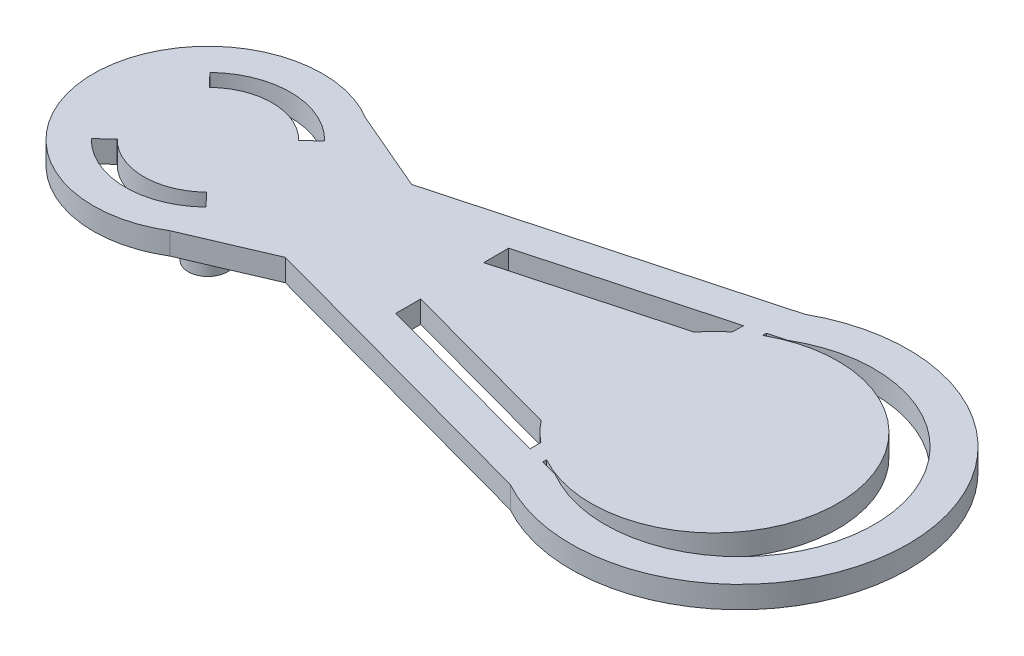
ISO-10303-21;
HEADER;
FILE_DESCRIPTION(('STEP AP214'),'2;1');
FILE_NAME('part.step','',(''),(''),'','','');
FILE_SCHEMA(('AUTOMOTIVE_DESIGN { 1 0 10303 214 1 1 1 1 }'));
ENDSEC;
DATA;
#1=APPLICATION_CONTEXT('core data for automotive mechanical design processes');
#2=APPLICATION_PROTOCOL_DEFINITION('international standard','automotive_design',2000,#1);
#3=PRODUCT_CONTEXT('',#1,'mechanical');
#4=PRODUCT('Part','Part','',(#3));
#5=PRODUCT_RELATED_PRODUCT_CATEGORY('part','',(#4));
#6=PRODUCT_DEFINITION_FORMATION('','',#4);
#7=PRODUCT_DEFINITION_CONTEXT('part definition',#1,'design');
#8=PRODUCT_DEFINITION('design','',#6,#7);
#9=PRODUCT_DEFINITION_SHAPE('','',#8);
#10=(LENGTH_UNIT() NAMED_UNIT(*) SI_UNIT(.MILLI.,.METRE.));
#11=(NAMED_UNIT(*) PLANE_ANGLE_UNIT() SI_UNIT($,.RADIAN.));
#12=(NAMED_UNIT(*) SI_UNIT($,.STERADIAN.) SOLID_ANGLE_UNIT());
#13=UNCERTAINTY_MEASURE_WITH_UNIT(LENGTH_MEASURE(1.E-05),#10,'distance_accuracy_value','');
#14=(GEOMETRIC_REPRESENTATION_CONTEXT(3) GLOBAL_UNCERTAINTY_ASSIGNED_CONTEXT((#13)) GLOBAL_UNIT_ASSIGNED_CONTEXT((#10,
#11,#12)) REPRESENTATION_CONTEXT('',''));
#15=CARTESIAN_POINT('',(0.,0.,0.));
#16=DIRECTION('',(0.,0.,1.));
#17=DIRECTION('',(1.,0.,0.));
#18=AXIS2_PLACEMENT_3D('',#15,#16,#17);
#19=CARTESIAN_POINT('',(0.,2.4,0.));
#20=DIRECTION('',(0.,1.,0.));
#21=DIRECTION('',(0.,0.,1.));
#22=AXIS2_PLACEMENT_3D('',#19,#20,#21);
#23=PLANE('',#22);
#24=DIRECTION('',(0.,0.,-1.));
#25=VECTOR('',#24,1.);
#26=CARTESIAN_POINT('',(-6.18025124375058,2.4,0.));
#27=LINE('',#26,#25);
#28=CARTESIAN_POINT('',(-6.18025124375058,2.4,12.1675980929111));
#29=VERTEX_POINT('',#28);
#30=CARTESIAN_POINT('',(-6.18025124375058,2.4,11.7587258032237));
#31=VERTEX_POINT('',#30);
#32=EDGE_CURVE('E319',#29,#31,#27,.T.);
#33=ORIENTED_EDGE('',*,*,#32,.T.);
#34=CARTESIAN_POINT('',(0.375497612093148,2.4,-9.56283843642691E-05));
#35=DIRECTION('',(0.,1.,0.));
#36=DIRECTION('',(0.,0.,1.));
#37=AXIS2_PLACEMENT_3D('',#34,#35,#36);
#38=CIRCLE('',#37,13.4628275084152);
#39=CARTESIAN_POINT('',(-6.14581100541854,2.4,-11.7780520910526));
#40=VERTEX_POINT('',#39);
#41=EDGE_CURVE('E1031',#31,#40,#38,.T.);
#42=ORIENTED_EDGE('',*,*,#41,.T.);
#43=DIRECTION('',(0.,0.,1.));
#44=VECTOR('',#43,1.);
#45=CARTESIAN_POINT('',(-6.14581100541854,2.4,0.));
#46=LINE('',#45,#44);
#47=CARTESIAN_POINT('',(-6.14581100541854,2.4,-12.1772605223885));
#48=VERTEX_POINT('',#47);
#49=EDGE_CURVE('E1034',#48,#40,#46,.T.);
#50=ORIENTED_EDGE('',*,*,#49,.F.);
#51=DIRECTION('',(-0.96486001562385,0.,0.262764438709547));
#52=VECTOR('',#51,1.);
#53=CARTESIAN_POINT('',(-3.51165026939695,2.4,-12.8946327381123));
#54=LINE('',#53,#52);
#55=CARTESIAN_POINT('',(-4.33622575678674,2.4,-12.6700725826399));
#56=VERTEX_POINT('',#55);
#57=EDGE_CURVE('E1040',#56,#48,#54,.T.);
#58=ORIENTED_EDGE('',*,*,#57,.F.);
#59=CARTESIAN_POINT('',(3.11758271611062,2.4,0.));
#60=DIRECTION('',(0.,1.,0.));
#61=DIRECTION('',(0.,0.,1.));
#62=AXIS2_PLACEMENT_3D('',#59,#60,#61);
#63=CIRCLE('',#62,14.7);
#64=CARTESIAN_POINT('',(-4.33694420692001,2.4,12.6696498907354));
#65=VERTEX_POINT('',#64);
#66=EDGE_CURVE('E1111',#65,#56,#63,.T.);
#67=ORIENTED_EDGE('',*,*,#66,.F.);
#68=DIRECTION('',(-0.964852565148683,0.,-0.262791795012719));
#69=VECTOR('',#68,1.);
#70=CARTESIAN_POINT('',(-3.51196467211747,2.4,12.8943452075438));
#71=LINE('',#70,#69);
#72=EDGE_CURVE('E1106',#65,#29,#71,.T.);
#73=ORIENTED_EDGE('',*,*,#72,.T.);
#74=EDGE_LOOP('',(#33,#42,#50,#58,#67,#73));
#75=FACE_BOUND('',#74,.T.);
#76=DIRECTION('',(0.9191008428755,0.,-0.39402238594469));
#77=VECTOR('',#76,1.);
#78=CARTESIAN_POINT('',(-3.64561910552785,2.4,-8.50381022047823));
#79=LINE('',#78,#77);
#80=CARTESIAN_POINT('',(-48.3711591182894,2.4,10.6702163567993));
#81=VERTEX_POINT('',#80);
#82=CARTESIAN_POINT('',(-39.556221528314,2.4,6.89121564313538));
#83=VERTEX_POINT('',#82);
#84=EDGE_CURVE('E408',#81,#83,#79,.T.);
#85=ORIENTED_EDGE('',*,*,#84,.T.);
#86=DIRECTION('',(0.964852565148683,0.,0.262791795012719));
#87=VECTOR('',#86,1.);
#88=CARTESIAN_POINT('',(-4.47903847776427,2.4,16.445002647291));
#89=LINE('',#88,#87);
#90=CARTESIAN_POINT('',(-5.82391822624473,2.4,16.0787048563689));
#91=VERTEX_POINT('',#90);
#92=EDGE_CURVE('E1099',#83,#91,#89,.T.);
#93=ORIENTED_EDGE('',*,*,#92,.T.);
#94=CARTESIAN_POINT('',(3.11758271611062,2.4,0.));
#95=DIRECTION('',(0.,1.,0.));
#96=DIRECTION('',(0.,0.,1.));
#97=AXIS2_PLACEMENT_3D('',#94,#95,#96);
#98=CIRCLE('',#97,18.3976952078342);
#99=CARTESIAN_POINT('',(-5.82753663345124,2.4,-16.0766920970222));
#100=VERTEX_POINT('',#99);
#101=EDGE_CURVE('E1096',#91,#100,#98,.T.);
#102=ORIENTED_EDGE('',*,*,#101,.T.);
#103=DIRECTION('',(0.96486001562385,0.,-0.262764438709547));
#104=VECTOR('',#103,1.);
#105=CARTESIAN_POINT('',(-4.47830136587958,2.4,-16.4441350856732));
#106=LINE('',#105,#104);
#107=CARTESIAN_POINT('',(-39.556221528314,2.4,-6.89121564313537));
#108=VERTEX_POINT('',#107);
#109=EDGE_CURVE('E1092',#108,#100,#106,.T.);
#110=ORIENTED_EDGE('',*,*,#109,.F.);
#111=DIRECTION('',(0.919100842875499,0.,0.394022385944691));
#112=VECTOR('',#111,1.);
#113=CARTESIAN_POINT('',(-3.64561910552788,2.4,8.50381022047827));
#114=LINE('',#113,#112);
#115=CARTESIAN_POINT('',(-48.3711591182894,2.4,-10.6702163567993));
#116=VERTEX_POINT('',#115);
#117=EDGE_CURVE('E1088',#116,#108,#114,.T.);
#118=ORIENTED_EDGE('',*,*,#117,.F.);
#119=CARTESIAN_POINT('',(-54.8824172838894,2.4,0.));
#120=DIRECTION('',(0.,1.,0.));
#121=DIRECTION('',(0.,0.,1.));
#122=AXIS2_PLACEMENT_3D('',#119,#120,#121);
#123=CIRCLE('',#122,12.5);
#124=EDGE_CURVE('E1085',#116,#81,#123,.T.);
#125=ORIENTED_EDGE('',*,*,#124,.T.);
#126=EDGE_LOOP('',(#85,#93,#102,#110,#118,#125));
#127=FACE_BOUND('',#126,.T.);
#128=DIRECTION('',(0.964852565148683,0.,0.262791795012719));
#129=VECTOR('',#128,1.);
#130=CARTESIAN_POINT('',(-2.82082225123402,2.4,10.3567829612028));
#131=LINE('',#130,#129);
#132=CARTESIAN_POINT('',(-28.2349134176837,2.4,3.43488123498516));
#133=VERTEX_POINT('',#132);
#134=CARTESIAN_POINT('',(-10.1839219187337,2.4,8.35133441043729));
#135=VERTEX_POINT('',#134);
#136=EDGE_CURVE('E414',#133,#135,#131,.T.);
#137=ORIENTED_EDGE('',*,*,#136,.T.);
#138=CARTESIAN_POINT('',(0.375497612093148,2.4,-9.56283843642691E-05));
#139=DIRECTION('',(0.,1.,0.));
#140=DIRECTION('',(0.,0.,1.));
#141=AXIS2_PLACEMENT_3D('',#138,#139,#140);
#142=CIRCLE('',#141,13.4628275084152);
#143=CARTESIAN_POINT('',(-8.1227588783313,2.4,10.4415211594651));
#144=VERTEX_POINT('',#143);
#145=EDGE_CURVE('E1080',#135,#144,#142,.T.);
#146=ORIENTED_EDGE('',*,*,#145,.T.);
#147=DIRECTION('',(-0.0145847739263874,0.,-0.999893636528164));
#148=VECTOR('',#147,1.);
#149=CARTESIAN_POINT('',(-8.27330206831559,2.4,0.120677075923863));
#150=LINE('',#149,#148);
#151=CARTESIAN_POINT('',(-8.10492728150916,2.4,11.6433842502474));
#152=VERTEX_POINT('',#151);
#153=EDGE_CURVE('E1075',#152,#144,#150,.T.);
#154=ORIENTED_EDGE('',*,*,#153,.F.);
#155=DIRECTION('',(-0.964852565148683,0.,-0.262791795012719));
#156=VECTOR('',#155,1.);
#157=CARTESIAN_POINT('',(-3.51196467211747,2.4,12.8943452075438));
#158=LINE('',#157,#156);
#159=CARTESIAN_POINT('',(-28.2349134176837,2.4,6.16068629059458));
#160=VERTEX_POINT('',#159);
#161=EDGE_CURVE('E1055',#152,#160,#158,.T.);
#162=ORIENTED_EDGE('',*,*,#161,.T.);
#163=DIRECTION('',(0.,0.,1.));
#164=VECTOR('',#163,1.);
#165=CARTESIAN_POINT('',(-28.2349134176837,2.4,0.));
#166=LINE('',#165,#164);
#167=EDGE_CURVE('E1051',#133,#160,#166,.T.);
#168=ORIENTED_EDGE('',*,*,#167,.F.);
#169=EDGE_LOOP('',(#137,#146,#154,#162,#168));
#170=FACE_BOUND('',#169,.T.);
#171=DIRECTION('',(-0.0123782056735885,0.,0.999923387077381));
#172=VECTOR('',#171,1.);
#173=CARTESIAN_POINT('',(-8.2475018721024,2.4,-0.102097096423137));
#174=LINE('',#173,#172);
#175=CARTESIAN_POINT('',(-8.10462525088231,2.4,-11.64380829366));
#176=VERTEX_POINT('',#175);
#177=CARTESIAN_POINT('',(-8.11947308663958,2.4,-10.4443858076648));
#178=VERTEX_POINT('',#177);
#179=EDGE_CURVE('E420',#176,#178,#174,.T.);
#180=ORIENTED_EDGE('',*,*,#179,.T.);
#181=CARTESIAN_POINT('',(-10.1847982189933,2.4,-8.3504175671649));
#182=VERTEX_POINT('',#181);
#183=EDGE_CURVE('E1036',#178,#182,#38,.T.);
#184=ORIENTED_EDGE('',*,*,#183,.T.);
#185=DIRECTION('',(0.96486001562385,0.,-0.262764438709547));
#186=VECTOR('',#185,1.);
#187=CARTESIAN_POINT('',(-2.82029980814216,2.4,-10.3560227948346));
#188=LINE('',#187,#186);
#189=CARTESIAN_POINT('',(-28.2349134176837,2.4,-3.43475279504777));
#190=VERTEX_POINT('',#189);
#191=EDGE_CURVE('E1043',#190,#182,#188,.T.);
#192=ORIENTED_EDGE('',*,*,#191,.F.);
#193=DIRECTION('',(0.,0.,1.));
#194=VECTOR('',#193,1.);
#195=CARTESIAN_POINT('',(-28.2349134176837,2.4,0.));
#196=LINE('',#195,#194);
#197=CARTESIAN_POINT('',(-28.2349134176837,2.4,-6.16164115484354));
#198=VERTEX_POINT('',#197);
#199=EDGE_CURVE('E1049',#198,#190,#196,.T.);
#200=ORIENTED_EDGE('',*,*,#199,.F.);
#201=DIRECTION('',(-0.96486001562385,0.,0.262764438709547));
#202=VECTOR('',#201,1.);
#203=CARTESIAN_POINT('',(-3.51165026939695,2.4,-12.8946327381123));
#204=LINE('',#203,#202);
#205=EDGE_CURVE('E884',#176,#198,#204,.T.);
#206=ORIENTED_EDGE('',*,*,#205,.F.);
#207=EDGE_LOOP('',(#180,#184,#192,#200,#206));
#208=FACE_BOUND('',#207,.T.);
#209=DIRECTION('',(-0.718496865807688,0.,0.695530196198935));
#210=VECTOR('',#209,1.);
#211=CARTESIAN_POINT('',(-26.5500418805926,2.4,-27.4267342848944));
#212=LINE('',#211,#210);
#213=CARTESIAN_POINT('',(-59.9118953413841,2.4,4.86871137033442));
#214=VERTEX_POINT('',#213);
#215=CARTESIAN_POINT('',(-61.3488890729995,2.4,6.25977176273229));
#216=VERTEX_POINT('',#215);
#217=EDGE_CURVE('E283',#214,#216,#212,.T.);
#218=ORIENTED_EDGE('',*,*,#217,.F.);
#219=CARTESIAN_POINT('',(-54.8824172838894,2.4,0.));
#220=DIRECTION('',(0.,1.,0.));
#221=DIRECTION('',(0.,0.,1.));
#222=AXIS2_PLACEMENT_3D('',#219,#220,#221);
#223=CIRCLE('',#222,6.99999999560317);
#224=CARTESIAN_POINT('',(-50.013705913555,2.4,5.02947805749471));
#225=VERTEX_POINT('',#224);
#226=EDGE_CURVE('E69',#214,#225,#223,.T.);
#227=ORIENTED_EDGE('',*,*,#226,.T.);
#228=DIRECTION('',(0.695530196198935,0.,0.718496865807688));
#229=VECTOR('',#228,1.);
#230=CARTESIAN_POINT('',(-28.3323754032968,2.4,27.4267342848944));
#231=LINE('',#230,#229);
#232=CARTESIAN_POINT('',(-48.6226455211571,2.4,6.46647178911009));
#233=VERTEX_POINT('',#232);
#234=EDGE_CURVE('E291',#225,#233,#231,.T.);
#235=ORIENTED_EDGE('',*,*,#234,.T.);
#236=CARTESIAN_POINT('',(-54.8824172838894,2.4,0.));
#237=DIRECTION('',(0.,1.,0.));
#238=DIRECTION('',(0.,0.,1.));
#239=AXIS2_PLACEMENT_3D('',#236,#237,#238);
#240=CIRCLE('',#239,8.99999999560318);
#241=EDGE_CURVE('E287',#216,#233,#240,.T.);
#242=ORIENTED_EDGE('',*,*,#241,.F.);
#243=EDGE_LOOP('',(#218,#227,#235,#242));
#244=FACE_BOUND('',#243,.T.);
#245=DIRECTION('',(-0.718496865807688,0.,0.695530196198935));
#246=VECTOR('',#245,1.);
#247=CARTESIAN_POINT('',(-26.5500418805926,2.4,-27.4267342848944));
#248=LINE('',#247,#246);
#249=CARTESIAN_POINT('',(-48.4159454947793,2.4,-6.2597717627323));
#250=VERTEX_POINT('',#249);
#251=CARTESIAN_POINT('',(-49.8529392263947,2.4,-4.86871137033442));
#252=VERTEX_POINT('',#251);
#253=EDGE_CURVE('E260',#250,#252,#248,.T.);
#254=ORIENTED_EDGE('',*,*,#253,.T.);
#255=CARTESIAN_POINT('',(-54.8824172838894,2.4,0.));
#256=DIRECTION('',(0.,1.,0.));
#257=DIRECTION('',(0.,0.,1.));
#258=AXIS2_PLACEMENT_3D('',#255,#256,#257);
#259=CIRCLE('',#258,6.99999999560317);
#260=CARTESIAN_POINT('',(-59.7511286542238,2.4,-5.02947805749471));
#261=VERTEX_POINT('',#260);
#262=EDGE_CURVE('E61',#252,#261,#259,.T.);
#263=ORIENTED_EDGE('',*,*,#262,.T.);
#264=DIRECTION('',(0.695530196198935,0.,0.718496865807688));
#265=VECTOR('',#264,1.);
#266=CARTESIAN_POINT('',(-28.3323754032968,2.4,27.4267342848944));
#267=LINE('',#266,#265);
#268=CARTESIAN_POINT('',(-61.1421890466217,2.4,-6.46647178911008));
#269=VERTEX_POINT('',#268);
#270=EDGE_CURVE('E266',#269,#261,#267,.T.);
#271=ORIENTED_EDGE('',*,*,#270,.F.);
#272=CARTESIAN_POINT('',(-54.8824172838894,2.4,0.));
#273=DIRECTION('',(0.,1.,0.));
#274=DIRECTION('',(0.,0.,1.));
#275=AXIS2_PLACEMENT_3D('',#272,#273,#274);
#276=CIRCLE('',#275,8.99999999560318);
#277=EDGE_CURVE('E249',#250,#269,#276,.T.);
#278=ORIENTED_EDGE('',*,*,#277,.F.);
#279=EDGE_LOOP('',(#254,#263,#271,#278));
#280=FACE_BOUND('',#279,.T.);
#281=ADVANCED_FACE('F44',(#75,#127,#170,#208,#244,#280),#23,.T.);
#282=CARTESIAN_POINT('',(0.,0.,0.));
#283=DIRECTION('',(0.,1.,0.));
#284=DIRECTION('',(0.,0.,1.));
#285=AXIS2_PLACEMENT_3D('',#282,#283,#284);
#286=PLANE('',#285);
#287=CARTESIAN_POINT('',(-54.8824172838894,0.,0.));
#288=DIRECTION('',(0.,1.,0.));
#289=DIRECTION('',(0.,0.,1.));
#290=AXIS2_PLACEMENT_3D('',#287,#288,#289);
#291=CIRCLE('',#290,6.99999999560317);
#292=CARTESIAN_POINT('',(-59.9118953413841,0.,4.86871137033442));
#293=VERTEX_POINT('',#292);
#294=CARTESIAN_POINT('',(-50.013705913555,0.,5.02947805749471));
#295=VERTEX_POINT('',#294);
#296=EDGE_CURVE('E364',#293,#295,#291,.T.);
#297=ORIENTED_EDGE('',*,*,#296,.F.);
#298=DIRECTION('',(-0.718496865807688,0.,0.695530196198935));
#299=VECTOR('',#298,1.);
#300=CARTESIAN_POINT('',(-26.5500418805926,0.,-27.4267342848944));
#301=LINE('',#300,#299);
#302=CARTESIAN_POINT('',(-61.3488890729995,0.,6.25977176273229));
#303=VERTEX_POINT('',#302);
#304=EDGE_CURVE('E347',#293,#303,#301,.T.);
#305=ORIENTED_EDGE('',*,*,#304,.T.);
#306=CARTESIAN_POINT('',(-54.8824172838894,0.,0.));
#307=DIRECTION('',(0.,1.,0.));
#308=DIRECTION('',(0.,0.,1.));
#309=AXIS2_PLACEMENT_3D('',#306,#307,#308);
#310=CIRCLE('',#309,8.99999999560318);
#311=CARTESIAN_POINT('',(-48.6226455211571,0.,6.46647178911009));
#312=VERTEX_POINT('',#311);
#313=EDGE_CURVE('E356',#303,#312,#310,.T.);
#314=ORIENTED_EDGE('',*,*,#313,.T.);
#315=DIRECTION('',(0.695530196198935,0.,0.718496865807688));
#316=VECTOR('',#315,1.);
#317=CARTESIAN_POINT('',(-28.3323754032968,0.,27.4267342848944));
#318=LINE('',#317,#316);
#319=EDGE_CURVE('E361',#295,#312,#318,.T.);
#320=ORIENTED_EDGE('',*,*,#319,.F.);
#321=EDGE_LOOP('',(#297,#305,#314,#320));
#322=FACE_BOUND('',#321,.T.);
#323=CARTESIAN_POINT('',(-54.8824198469725,0.,-1.14636437971353E-05));
#324=DIRECTION('',(0.,1.,0.));
#325=DIRECTION('',(0.,0.,1.));
#326=AXIS2_PLACEMENT_3D('',#323,#324,#325);
#327=CIRCLE('',#326,2.15001174668141);
#328=CARTESIAN_POINT('',(-54.8824198469725,0.,2.15000028303762));
#329=VERTEX_POINT('',#328);
#330=EDGE_CURVE('E861',#329,#329,#327,.T.);
#331=ORIENTED_EDGE('',*,*,#330,.T.);
#332=EDGE_LOOP('',(#331));
#333=FACE_BOUND('',#332,.T.);
#334=DIRECTION('',(0.,0.,-1.));
#335=VECTOR('',#334,1.);
#336=CARTESIAN_POINT('',(-6.18025124375058,0.,0.));
#337=LINE('',#336,#335);
#338=CARTESIAN_POINT('',(-6.18025124375058,0.,12.1675980929111));
#339=VERTEX_POINT('',#338);
#340=CARTESIAN_POINT('',(-6.18025124375058,0.,11.7587258032237));
#341=VERTEX_POINT('',#340);
#342=EDGE_CURVE('E870',#339,#341,#337,.T.);
#343=ORIENTED_EDGE('',*,*,#342,.F.);
#344=DIRECTION('',(-0.964852565148683,0.,-0.262791795012719));
#345=VECTOR('',#344,1.);
#346=CARTESIAN_POINT('',(-3.51196467211747,0.,12.8943452075438));
#347=LINE('',#346,#345);
#348=CARTESIAN_POINT('',(-4.33694420692001,0.,12.6696498907354));
#349=VERTEX_POINT('',#348);
#350=EDGE_CURVE('E899',#349,#339,#347,.T.);
#351=ORIENTED_EDGE('',*,*,#350,.F.);
#352=CARTESIAN_POINT('',(3.11758271611062,0.,0.));
#353=DIRECTION('',(0.,1.,0.));
#354=DIRECTION('',(0.,0.,1.));
#355=AXIS2_PLACEMENT_3D('',#352,#353,#354);
#356=CIRCLE('',#355,14.7);
#357=CARTESIAN_POINT('',(-4.33622575678674,0.,-12.6700725826399));
#358=VERTEX_POINT('',#357);
#359=EDGE_CURVE('E895',#349,#358,#356,.T.);
#360=ORIENTED_EDGE('',*,*,#359,.T.);
#361=DIRECTION('',(-0.96486001562385,0.,0.262764438709547));
#362=VECTOR('',#361,1.);
#363=CARTESIAN_POINT('',(-3.51165026939695,0.,-12.8946327381123));
#364=LINE('',#363,#362);
#365=CARTESIAN_POINT('',(-6.14581100541854,0.,-12.1772605223885));
#366=VERTEX_POINT('',#365);
#367=EDGE_CURVE('E891',#358,#366,#364,.T.);
#368=ORIENTED_EDGE('',*,*,#367,.T.);
#369=DIRECTION('',(0.,0.,1.));
#370=VECTOR('',#369,1.);
#371=CARTESIAN_POINT('',(-6.14581100541854,0.,0.));
#372=LINE('',#371,#370);
#373=CARTESIAN_POINT('',(-6.14581100541854,0.,-11.7780520910526));
#374=VERTEX_POINT('',#373);
#375=EDGE_CURVE('E879',#366,#374,#372,.T.);
#376=ORIENTED_EDGE('',*,*,#375,.T.);
#377=CARTESIAN_POINT('',(0.375497612093148,0.,-9.56283843642691E-05));
#378=DIRECTION('',(0.,1.,0.));
#379=DIRECTION('',(0.,0.,1.));
#380=AXIS2_PLACEMENT_3D('',#377,#378,#379);
#381=CIRCLE('',#380,13.4628275084152);
#382=EDGE_CURVE('E874',#341,#374,#381,.T.);
#383=ORIENTED_EDGE('',*,*,#382,.F.);
#384=EDGE_LOOP('',(#343,#351,#360,#368,#376,#383));
#385=FACE_BOUND('',#384,.T.);
#386=DIRECTION('',(0.9191008428755,0.,-0.39402238594469));
#387=VECTOR('',#386,1.);
#388=CARTESIAN_POINT('',(-3.64561910552785,0.,-8.50381022047823));
#389=LINE('',#388,#387);
#390=CARTESIAN_POINT('',(-48.3711591182894,0.,10.6702163567993));
#391=VERTEX_POINT('',#390);
#392=CARTESIAN_POINT('',(-39.556221528314,0.,6.89121564313538));
#393=VERTEX_POINT('',#392);
#394=EDGE_CURVE('E902',#391,#393,#389,.T.);
#395=ORIENTED_EDGE('',*,*,#394,.F.);
#396=CARTESIAN_POINT('',(-54.8824172838894,0.,0.));
#397=DIRECTION('',(0.,1.,0.));
#398=DIRECTION('',(0.,0.,1.));
#399=AXIS2_PLACEMENT_3D('',#396,#397,#398);
#400=CIRCLE('',#399,12.5);
#401=CARTESIAN_POINT('',(-48.3711591182894,0.,-10.6702163567993));
#402=VERTEX_POINT('',#401);
#403=EDGE_CURVE('E925',#402,#391,#400,.T.);
#404=ORIENTED_EDGE('',*,*,#403,.F.);
#405=DIRECTION('',(0.919100842875499,0.,0.394022385944691));
#406=VECTOR('',#405,1.);
#407=CARTESIAN_POINT('',(-3.64561910552788,0.,8.50381022047827));
#408=LINE('',#407,#406);
#409=CARTESIAN_POINT('',(-39.556221528314,0.,-6.89121564313537));
#410=VERTEX_POINT('',#409);
#411=EDGE_CURVE('E921',#402,#410,#408,.T.);
#412=ORIENTED_EDGE('',*,*,#411,.T.);
#413=DIRECTION('',(0.96486001562385,0.,-0.262764438709547));
#414=VECTOR('',#413,1.);
#415=CARTESIAN_POINT('',(-4.47830136587958,0.,-16.4441350856732));
#416=LINE('',#415,#414);
#417=CARTESIAN_POINT('',(-5.82753663345124,0.,-16.0766920970222));
#418=VERTEX_POINT('',#417);
#419=EDGE_CURVE('E917',#410,#418,#416,.T.);
#420=ORIENTED_EDGE('',*,*,#419,.T.);
#421=CARTESIAN_POINT('',(3.11758271611062,0.,0.));
#422=DIRECTION('',(0.,1.,0.));
#423=DIRECTION('',(0.,0.,1.));
#424=AXIS2_PLACEMENT_3D('',#421,#422,#423);
#425=CIRCLE('',#424,18.3976952078342);
#426=CARTESIAN_POINT('',(-5.82391822624473,0.,16.0787048563689));
#427=VERTEX_POINT('',#426);
#428=EDGE_CURVE('E911',#427,#418,#425,.T.);
#429=ORIENTED_EDGE('',*,*,#428,.F.);
#430=DIRECTION('',(0.964852565148683,0.,0.262791795012719));
#431=VECTOR('',#430,1.);
#432=CARTESIAN_POINT('',(-4.47903847776427,0.,16.445002647291));
#433=LINE('',#432,#431);
#434=EDGE_CURVE('E908',#393,#427,#433,.T.);
#435=ORIENTED_EDGE('',*,*,#434,.F.);
#436=EDGE_LOOP('',(#395,#404,#412,#420,#429,#435));
#437=FACE_BOUND('',#436,.T.);
#438=DIRECTION('',(0.964852565148683,0.,0.262791795012719));
#439=VECTOR('',#438,1.);
#440=CARTESIAN_POINT('',(-2.82082225123402,0.,10.3567829612028));
#441=LINE('',#440,#439);
#442=CARTESIAN_POINT('',(-28.2349134176837,0.,3.43488123498516));
#443=VERTEX_POINT('',#442);
#444=CARTESIAN_POINT('',(-10.1839219187337,0.,8.35133441043729));
#445=VERTEX_POINT('',#444);
#446=EDGE_CURVE('E928',#443,#445,#441,.T.);
#447=ORIENTED_EDGE('',*,*,#446,.F.);
#448=DIRECTION('',(0.,0.,1.));
#449=VECTOR('',#448,1.);
#450=CARTESIAN_POINT('',(-28.2349134176837,0.,0.));
#451=LINE('',#450,#449);
#452=CARTESIAN_POINT('',(-28.2349134176837,0.,6.16068629059458));
#453=VERTEX_POINT('',#452);
#454=EDGE_CURVE('E946',#443,#453,#451,.T.);
#455=ORIENTED_EDGE('',*,*,#454,.T.);
#456=DIRECTION('',(-0.964852565148683,0.,-0.262791795012719));
#457=VECTOR('',#456,1.);
#458=CARTESIAN_POINT('',(-3.51196467211747,0.,12.8943452075438));
#459=LINE('',#458,#457);
#460=CARTESIAN_POINT('',(-8.10492728150916,0.,11.6433842502474));
#461=VERTEX_POINT('',#460);
#462=EDGE_CURVE('E940',#461,#453,#459,.T.);
#463=ORIENTED_EDGE('',*,*,#462,.F.);
#464=DIRECTION('',(-0.0145847739263874,0.,-0.999893636528164));
#465=VECTOR('',#464,1.);
#466=CARTESIAN_POINT('',(-8.27330206831559,0.,0.120677075923863));
#467=LINE('',#466,#465);
#468=CARTESIAN_POINT('',(-8.1227588783313,0.,10.4415211594651));
#469=VERTEX_POINT('',#468);
#470=EDGE_CURVE('E936',#461,#469,#467,.T.);
#471=ORIENTED_EDGE('',*,*,#470,.T.);
#472=CARTESIAN_POINT('',(0.375497612093148,0.,-9.56283843642691E-05));
#473=DIRECTION('',(0.,1.,0.));
#474=DIRECTION('',(0.,0.,1.));
#475=AXIS2_PLACEMENT_3D('',#472,#473,#474);
#476=CIRCLE('',#475,13.4628275084152);
#477=EDGE_CURVE('E932',#445,#469,#476,.T.);
#478=ORIENTED_EDGE('',*,*,#477,.F.);
#479=EDGE_LOOP('',(#447,#455,#463,#471,#478));
#480=FACE_BOUND('',#479,.T.);
#481=DIRECTION('',(-0.0123782056735885,0.,0.999923387077381));
#482=VECTOR('',#481,1.);
#483=CARTESIAN_POINT('',(-8.2475018721024,0.,-0.102097096423137));
#484=LINE('',#483,#482);
#485=CARTESIAN_POINT('',(-8.10462525088231,0.,-11.64380829366));
#486=VERTEX_POINT('',#485);
#487=CARTESIAN_POINT('',(-8.11947308663958,0.,-10.4443858076648));
#488=VERTEX_POINT('',#487);
#489=EDGE_CURVE('E952',#486,#488,#484,.T.);
#490=ORIENTED_EDGE('',*,*,#489,.F.);
#491=DIRECTION('',(-0.96486001562385,0.,0.262764438709547));
#492=VECTOR('',#491,1.);
#493=CARTESIAN_POINT('',(-3.51165026939695,0.,-12.8946327381123));
#494=LINE('',#493,#492);
#495=CARTESIAN_POINT('',(-28.2349134176837,0.,-6.16164115484354));
#496=VERTEX_POINT('',#495);
#497=EDGE_CURVE('E963',#486,#496,#494,.T.);
#498=ORIENTED_EDGE('',*,*,#497,.T.);
#499=DIRECTION('',(0.,0.,1.));
#500=VECTOR('',#499,1.);
#501=CARTESIAN_POINT('',(-28.2349134176837,0.,0.));
#502=LINE('',#501,#500);
#503=CARTESIAN_POINT('',(-28.2349134176837,0.,-3.43475279504777));
#504=VERTEX_POINT('',#503);
#505=EDGE_CURVE('E959',#496,#504,#502,.T.);
#506=ORIENTED_EDGE('',*,*,#505,.T.);
#507=DIRECTION('',(0.96486001562385,0.,-0.262764438709547));
#508=VECTOR('',#507,1.);
#509=CARTESIAN_POINT('',(-2.82029980814216,0.,-10.3560227948346));
#510=LINE('',#509,#508);
#511=CARTESIAN_POINT('',(-10.1847982189933,0.,-8.3504175671649));
#512=VERTEX_POINT('',#511);
#513=EDGE_CURVE('E955',#504,#512,#510,.T.);
#514=ORIENTED_EDGE('',*,*,#513,.T.);
#515=EDGE_CURVE('E881',#488,#512,#381,.T.);
#516=ORIENTED_EDGE('',*,*,#515,.F.);
#517=EDGE_LOOP('',(#490,#498,#506,#514,#516));
#518=FACE_BOUND('',#517,.T.);
#519=CARTESIAN_POINT('',(-54.8824172838894,0.,0.));
#520=DIRECTION('',(0.,1.,0.));
#521=DIRECTION('',(0.,0.,1.));
#522=AXIS2_PLACEMENT_3D('',#519,#520,#521);
#523=CIRCLE('',#522,6.99999999560317);
#524=CARTESIAN_POINT('',(-49.8529392263947,0.,-4.86871137033442));
#525=VERTEX_POINT('',#524);
#526=CARTESIAN_POINT('',(-59.7511286542238,0.,-5.02947805749471));
#527=VERTEX_POINT('',#526);
#528=EDGE_CURVE('E11',#525,#527,#523,.T.);
#529=ORIENTED_EDGE('',*,*,#528,.F.);
#530=DIRECTION('',(-0.718496865807688,0.,0.695530196198935));
#531=VECTOR('',#530,1.);
#532=CARTESIAN_POINT('',(-26.5500418805926,0.,-27.4267342848944));
#533=LINE('',#532,#531);
#534=CARTESIAN_POINT('',(-48.4159454947793,0.,-6.2597717627323));
#535=VERTEX_POINT('',#534);
#536=EDGE_CURVE('E367',#535,#525,#533,.T.);
#537=ORIENTED_EDGE('',*,*,#536,.F.);
#538=CARTESIAN_POINT('',(-54.8824172838894,0.,0.));
#539=DIRECTION('',(0.,1.,0.));
#540=DIRECTION('',(0.,0.,1.));
#541=AXIS2_PLACEMENT_3D('',#538,#539,#540);
#542=CIRCLE('',#541,8.99999999560318);
#543=CARTESIAN_POINT('',(-61.1421890466217,0.,-6.46647178911008));
#544=VERTEX_POINT('',#543);
#545=EDGE_CURVE('E252',#535,#544,#542,.T.);
#546=ORIENTED_EDGE('',*,*,#545,.T.);
#547=DIRECTION('',(0.695530196198935,0.,0.718496865807688));
#548=VECTOR('',#547,1.);
#549=CARTESIAN_POINT('',(-28.3323754032968,0.,27.4267342848944));
#550=LINE('',#549,#548);
#551=EDGE_CURVE('E54',#544,#527,#550,.T.);
#552=ORIENTED_EDGE('',*,*,#551,.T.);
#553=EDGE_LOOP('',(#529,#537,#546,#552));
#554=FACE_BOUND('',#553,.T.);
#555=ADVANCED_FACE('F375',(#322,#333,#385,#437,#480,#518,#554),#286,.F.);
#556=CARTESIAN_POINT('',(-8.2475018721024,2.4,-0.102097096423137));
#557=DIRECTION('',(0.999923387077381,0.,0.0123782056735885));
#558=DIRECTION('',(0.0123782056735885,0.,-0.999923387077381));
#559=AXIS2_PLACEMENT_3D('',#556,#557,#558);
#560=PLANE('',#559);
#561=ORIENTED_EDGE('',*,*,#489,.T.);
#562=DIRECTION('',(0.,-1.,0.));
#563=VECTOR('',#562,1.);
#564=CARTESIAN_POINT('',(-8.11947308663958,2.4,-10.4443858076648));
#565=LINE('',#564,#563);
#566=EDGE_CURVE('E357',#178,#488,#565,.T.);
#567=ORIENTED_EDGE('',*,*,#566,.F.);
#568=ORIENTED_EDGE('',*,*,#179,.F.);
#569=DIRECTION('',(0.,-1.,0.));
#570=VECTOR('',#569,1.);
#571=CARTESIAN_POINT('',(-8.10462525088231,2.4,-11.64380829366));
#572=LINE('',#571,#570);
#573=EDGE_CURVE('E967',#176,#486,#572,.T.);
#574=ORIENTED_EDGE('',*,*,#573,.T.);
#575=EDGE_LOOP('',(#561,#567,#568,#574));
#576=FACE_BOUND('',#575,.T.);
#577=ADVANCED_FACE('F399',(#576),#560,.F.);
#578=CARTESIAN_POINT('',(0.375497612093148,2.4,-9.56283843642691E-05));
#579=DIRECTION('',(0.,-1.,0.));
#580=DIRECTION('',(0.,0.,-1.));
#581=AXIS2_PLACEMENT_3D('',#578,#579,#580);
#582=CYLINDRICAL_SURFACE('',#581,13.4628275084152);
#583=ORIENTED_EDGE('',*,*,#515,.T.);
#584=DIRECTION('',(0.,-1.,0.));
#585=VECTOR('',#584,1.);
#586=CARTESIAN_POINT('',(-10.1847982189933,2.4,-8.3504175671649));
#587=LINE('',#586,#585);
#588=EDGE_CURVE('E977',#182,#512,#587,.T.);
#589=ORIENTED_EDGE('',*,*,#588,.F.);
#590=ORIENTED_EDGE('',*,*,#183,.F.);
#591=ORIENTED_EDGE('',*,*,#566,.T.);
#592=EDGE_LOOP('',(#583,#589,#590,#591));
#593=FACE_BOUND('',#592,.T.);
#594=ADVANCED_FACE('F631',(#593),#582,.T.);
#595=CARTESIAN_POINT('',(-2.82029980814216,2.4,-10.3560227948346));
#596=DIRECTION('',(-0.262764438709547,0.,-0.96486001562385));
#597=DIRECTION('',(-0.96486001562385,0.,0.262764438709547));
#598=AXIS2_PLACEMENT_3D('',#595,#596,#597);
#599=PLANE('',#598);
#600=ORIENTED_EDGE('',*,*,#513,.F.);
#601=DIRECTION('',(0.,-1.,0.));
#602=VECTOR('',#601,1.);
#603=CARTESIAN_POINT('',(-28.2349134176837,2.4,-3.43475279504777));
#604=LINE('',#603,#602);
#605=EDGE_CURVE('E974',#190,#504,#604,.T.);
#606=ORIENTED_EDGE('',*,*,#605,.F.);
#607=ORIENTED_EDGE('',*,*,#191,.T.);
#608=ORIENTED_EDGE('',*,*,#588,.T.);
#609=EDGE_LOOP('',(#600,#606,#607,#608));
#610=FACE_BOUND('',#609,.T.);
#611=ADVANCED_FACE('F738',(#610),#599,.T.);
#612=CARTESIAN_POINT('',(-28.2349134176837,2.4,0.));
#613=DIRECTION('',(1.,0.,0.));
#614=DIRECTION('',(0.,0.,-1.));
#615=AXIS2_PLACEMENT_3D('',#612,#613,#614);
#616=PLANE('',#615);
#617=ORIENTED_EDGE('',*,*,#505,.F.);
#618=DIRECTION('',(0.,-1.,0.));
#619=VECTOR('',#618,1.);
#620=CARTESIAN_POINT('',(-28.2349134176837,2.4,-6.16164115484354));
#621=LINE('',#620,#619);
#622=EDGE_CURVE('E970',#198,#496,#621,.T.);
#623=ORIENTED_EDGE('',*,*,#622,.F.);
#624=ORIENTED_EDGE('',*,*,#199,.T.);
#625=ORIENTED_EDGE('',*,*,#605,.T.);
#626=EDGE_LOOP('',(#617,#623,#624,#625));
#627=FACE_BOUND('',#626,.T.);
#628=ADVANCED_FACE('F728',(#627),#616,.T.);
#629=CARTESIAN_POINT('',(-2.82082225123402,2.4,10.3567829612028));
#630=DIRECTION('',(0.262791795012719,0.,-0.964852565148683));
#631=DIRECTION('',(-0.964852565148683,0.,-0.262791795012719));
#632=AXIS2_PLACEMENT_3D('',#629,#630,#631);
#633=PLANE('',#632);
#634=ORIENTED_EDGE('',*,*,#446,.T.);
#635=DIRECTION('',(0.,-1.,0.));
#636=VECTOR('',#635,1.);
#637=CARTESIAN_POINT('',(-10.1839219187337,2.4,8.35133441043729));
#638=LINE('',#637,#636);
#639=EDGE_CURVE('E971',#135,#445,#638,.T.);
#640=ORIENTED_EDGE('',*,*,#639,.F.);
#641=ORIENTED_EDGE('',*,*,#136,.F.);
#642=DIRECTION('',(0.,-1.,0.));
#643=VECTOR('',#642,1.);
#644=CARTESIAN_POINT('',(-28.2349134176837,2.4,3.43488123498516));
#645=LINE('',#644,#643);
#646=EDGE_CURVE('E983',#133,#443,#645,.T.);
#647=ORIENTED_EDGE('',*,*,#646,.T.);
#648=EDGE_LOOP('',(#634,#640,#641,#647));
#649=FACE_BOUND('',#648,.T.);
#650=ADVANCED_FACE('F718',(#649),#633,.F.);
#651=CARTESIAN_POINT('',(0.375497612093148,2.4,-9.56283843642691E-05));
#652=DIRECTION('',(0.,-1.,0.));
#653=DIRECTION('',(0.,0.,-1.));
#654=AXIS2_PLACEMENT_3D('',#651,#652,#653);
#655=CYLINDRICAL_SURFACE('',#654,13.4628275084152);
#656=ORIENTED_EDGE('',*,*,#477,.T.);
#657=DIRECTION('',(0.,-1.,0.));
#658=VECTOR('',#657,1.);
#659=CARTESIAN_POINT('',(-8.1227588783313,2.4,10.4415211594651));
#660=LINE('',#659,#658);
#661=EDGE_CURVE('E990',#144,#469,#660,.T.);
#662=ORIENTED_EDGE('',*,*,#661,.F.);
#663=ORIENTED_EDGE('',*,*,#145,.F.);
#664=ORIENTED_EDGE('',*,*,#639,.T.);
#665=EDGE_LOOP('',(#656,#662,#663,#664));
#666=FACE_BOUND('',#665,.T.);
#667=ADVANCED_FACE('F708',(#666),#655,.T.);
#668=CARTESIAN_POINT('',(-8.27330206831559,2.4,0.120677075923863));
#669=DIRECTION('',(-0.999893636528164,0.,0.0145847739263874));
#670=DIRECTION('',(0.0145847739263874,0.,0.999893636528164));
#671=AXIS2_PLACEMENT_3D('',#668,#669,#670);
#672=PLANE('',#671);
#673=ORIENTED_EDGE('',*,*,#470,.F.);
#674=CARTESIAN_POINT('',(-8.10492728150916,2.4,11.6433842502474));
#675=DIRECTION('',(0.,-1.,0.));
#676=VECTOR('',#675,1.);
#677=LINE('',#674,#676);
#678=EDGE_CURVE('E833',#152,#461,#677,.T.);
#679=ORIENTED_EDGE('',*,*,#678,.F.);
#680=ORIENTED_EDGE('',*,*,#153,.T.);
#681=ORIENTED_EDGE('',*,*,#661,.T.);
#682=EDGE_LOOP('',(#673,#679,#680,#681));
#683=FACE_BOUND('',#682,.T.);
#684=ADVANCED_FACE('F698',(#683),#672,.T.);
#685=CARTESIAN_POINT('',(-3.51196467211747,2.4,12.8943452075438));
#686=DIRECTION('',(-0.262791795012719,0.,0.964852565148683));
#687=DIRECTION('',(0.964852565148683,0.,0.262791795012719));
#688=AXIS2_PLACEMENT_3D('',#685,#686,#687);
#689=PLANE('',#688);
#690=ORIENTED_EDGE('',*,*,#462,.T.);
#691=DIRECTION('',(0.,-1.,0.));
#692=VECTOR('',#691,1.);
#693=CARTESIAN_POINT('',(-28.2349134176837,2.4,6.16068629059458));
#694=LINE('',#693,#692);
#695=EDGE_CURVE('E986',#160,#453,#694,.T.);
#696=ORIENTED_EDGE('',*,*,#695,.F.);
#697=ORIENTED_EDGE('',*,*,#161,.F.);
#698=ORIENTED_EDGE('',*,*,#678,.T.);
#699=EDGE_LOOP('',(#690,#696,#697,#698));
#700=FACE_BOUND('',#699,.T.);
#701=ADVANCED_FACE('F688',(#700),#689,.F.);
#702=CARTESIAN_POINT('',(-3.64561910552785,2.4,-8.50381022047823));
#703=DIRECTION('',(-0.39402238594469,0.,-0.9191008428755));
#704=DIRECTION('',(-0.9191008428755,0.,0.39402238594469));
#705=AXIS2_PLACEMENT_3D('',#702,#703,#704);
#706=PLANE('',#705);
#707=ORIENTED_EDGE('',*,*,#394,.T.);
#708=DIRECTION('',(0.,-1.,0.));
#709=VECTOR('',#708,1.);
#710=CARTESIAN_POINT('',(-39.556221528314,2.4,6.89121564313538));
#711=LINE('',#710,#709);
#712=EDGE_CURVE('E987',#83,#393,#711,.T.);
#713=ORIENTED_EDGE('',*,*,#712,.F.);
#714=ORIENTED_EDGE('',*,*,#84,.F.);
#715=DIRECTION('',(0.,-1.,0.));
#716=VECTOR('',#715,1.);
#717=CARTESIAN_POINT('',(-48.3711591182894,2.4,10.6702163567993));
#718=LINE('',#717,#716);
#719=EDGE_CURVE('E996',#81,#391,#718,.T.);
#720=ORIENTED_EDGE('',*,*,#719,.T.);
#721=EDGE_LOOP('',(#707,#713,#714,#720));
#722=FACE_BOUND('',#721,.T.);
#723=ADVANCED_FACE('F678',(#722),#706,.F.);
#724=CARTESIAN_POINT('',(-4.47903847776427,2.4,16.445002647291));
#725=DIRECTION('',(0.262791795012719,0.,-0.964852565148683));
#726=DIRECTION('',(-0.964852565148683,0.,-0.262791795012719));
#727=AXIS2_PLACEMENT_3D('',#724,#725,#726);
#728=PLANE('',#727);
#729=ORIENTED_EDGE('',*,*,#434,.T.);
#730=DIRECTION('',(0.,-1.,0.));
#731=VECTOR('',#730,1.);
#732=CARTESIAN_POINT('',(-5.82391822624473,2.4,16.0787048563689));
#733=LINE('',#732,#731);
#734=EDGE_CURVE('E1010',#91,#427,#733,.T.);
#735=ORIENTED_EDGE('',*,*,#734,.F.);
#736=ORIENTED_EDGE('',*,*,#92,.F.);
#737=ORIENTED_EDGE('',*,*,#712,.T.);
#738=EDGE_LOOP('',(#729,#735,#736,#737));
#739=FACE_BOUND('',#738,.T.);
#740=ADVANCED_FACE('F668',(#739),#728,.F.);
#741=CARTESIAN_POINT('',(3.11758271611062,2.4,0.));
#742=DIRECTION('',(0.,-1.,0.));
#743=DIRECTION('',(0.,0.,-1.));
#744=AXIS2_PLACEMENT_3D('',#741,#742,#743);
#745=CYLINDRICAL_SURFACE('',#744,18.3976952078342);
#746=ORIENTED_EDGE('',*,*,#428,.T.);
#747=DIRECTION('',(0.,-1.,0.));
#748=VECTOR('',#747,1.);
#749=CARTESIAN_POINT('',(-5.82753663345124,2.4,-16.0766920970222));
#750=LINE('',#749,#748);
#751=EDGE_CURVE('E1007',#100,#418,#750,.T.);
#752=ORIENTED_EDGE('',*,*,#751,.F.);
#753=ORIENTED_EDGE('',*,*,#101,.F.);
#754=ORIENTED_EDGE('',*,*,#734,.T.);
#755=EDGE_LOOP('',(#746,#752,#753,#754));
#756=FACE_BOUND('',#755,.T.);
#757=ADVANCED_FACE('F658',(#756),#745,.T.);
#758=CARTESIAN_POINT('',(-4.47830136587958,2.4,-16.4441350856732));
#759=DIRECTION('',(-0.262764438709547,0.,-0.96486001562385));
#760=DIRECTION('',(-0.96486001562385,0.,0.262764438709547));
#761=AXIS2_PLACEMENT_3D('',#758,#759,#760);
#762=PLANE('',#761);
#763=ORIENTED_EDGE('',*,*,#419,.F.);
#764=DIRECTION('',(0.,-1.,0.));
#765=VECTOR('',#764,1.);
#766=CARTESIAN_POINT('',(-39.556221528314,2.4,-6.89121564313537));
#767=LINE('',#766,#765);
#768=EDGE_CURVE('E1004',#108,#410,#767,.T.);
#769=ORIENTED_EDGE('',*,*,#768,.F.);
#770=ORIENTED_EDGE('',*,*,#109,.T.);
#771=ORIENTED_EDGE('',*,*,#751,.T.);
#772=EDGE_LOOP('',(#763,#769,#770,#771));
#773=FACE_BOUND('',#772,.T.);
#774=ADVANCED_FACE('F648',(#773),#762,.T.);
#775=CARTESIAN_POINT('',(-3.64561910552788,2.4,8.50381022047827));
#776=DIRECTION('',(0.394022385944691,0.,-0.919100842875499));
#777=DIRECTION('',(-0.919100842875499,0.,-0.394022385944691));
#778=AXIS2_PLACEMENT_3D('',#775,#776,#777);
#779=PLANE('',#778);
#780=ORIENTED_EDGE('',*,*,#411,.F.);
#781=DIRECTION('',(0.,-1.,0.));
#782=VECTOR('',#781,1.);
#783=CARTESIAN_POINT('',(-48.3711591182894,2.4,-10.6702163567993));
#784=LINE('',#783,#782);
#785=EDGE_CURVE('E1000',#116,#402,#784,.T.);
#786=ORIENTED_EDGE('',*,*,#785,.F.);
#787=ORIENTED_EDGE('',*,*,#117,.T.);
#788=ORIENTED_EDGE('',*,*,#768,.T.);
#789=EDGE_LOOP('',(#780,#786,#787,#788));
#790=FACE_BOUND('',#789,.T.);
#791=ADVANCED_FACE('F639',(#790),#779,.T.);
#792=CARTESIAN_POINT('',(-6.18025124375058,2.4,0.));
#793=DIRECTION('',(-1.,0.,0.));
#794=DIRECTION('',(0.,0.,1.));
#795=AXIS2_PLACEMENT_3D('',#792,#793,#794);
#796=PLANE('',#795);
#797=ORIENTED_EDGE('',*,*,#342,.T.);
#798=DIRECTION('',(0.,-1.,0.));
#799=VECTOR('',#798,1.);
#800=CARTESIAN_POINT('',(-6.18025124375058,2.4,11.7587258032237));
#801=LINE('',#800,#799);
#802=EDGE_CURVE('E1001',#31,#341,#801,.T.);
#803=ORIENTED_EDGE('',*,*,#802,.F.);
#804=ORIENTED_EDGE('',*,*,#32,.F.);
#805=CARTESIAN_POINT('',(-6.18025124375058,2.4,12.1675980929111));
#806=DIRECTION('',(0.,-1.,0.));
#807=VECTOR('',#806,1.);
#808=LINE('',#805,#807);
#809=EDGE_CURVE('E847',#29,#339,#808,.T.);
#810=ORIENTED_EDGE('',*,*,#809,.T.);
#811=EDGE_LOOP('',(#797,#803,#804,#810));
#812=FACE_BOUND('',#811,.T.);
#813=ADVANCED_FACE('F46',(#812),#796,.F.);
#814=ORIENTED_EDGE('',*,*,#382,.T.);
#815=DIRECTION('',(0.,-1.,0.));
#816=VECTOR('',#815,1.);
#817=CARTESIAN_POINT('',(-6.14581100541854,2.4,-11.7780520910526));
#818=LINE('',#817,#816);
#819=EDGE_CURVE('E1026',#40,#374,#818,.T.);
#820=ORIENTED_EDGE('',*,*,#819,.F.);
#821=ORIENTED_EDGE('',*,*,#41,.F.);
#822=ORIENTED_EDGE('',*,*,#802,.T.);
#823=EDGE_LOOP('',(#814,#820,#821,#822));
#824=FACE_BOUND('',#823,.T.);
#825=ADVANCED_FACE('F620',(#824),#582,.T.);
#826=CARTESIAN_POINT('',(-6.14581100541854,2.4,0.));
#827=DIRECTION('',(1.,0.,0.));
#828=DIRECTION('',(0.,0.,-1.));
#829=AXIS2_PLACEMENT_3D('',#826,#827,#828);
#830=PLANE('',#829);
#831=ORIENTED_EDGE('',*,*,#375,.F.);
#832=DIRECTION('',(0.,-1.,0.));
#833=VECTOR('',#832,1.);
#834=CARTESIAN_POINT('',(-6.14581100541854,2.4,-12.1772605223885));
#835=LINE('',#834,#833);
#836=EDGE_CURVE('E1023',#48,#366,#835,.T.);
#837=ORIENTED_EDGE('',*,*,#836,.F.);
#838=ORIENTED_EDGE('',*,*,#49,.T.);
#839=ORIENTED_EDGE('',*,*,#819,.T.);
#840=EDGE_LOOP('',(#831,#837,#838,#839));
#841=FACE_BOUND('',#840,.T.);
#842=ADVANCED_FACE('F610',(#841),#830,.T.);
#843=CARTESIAN_POINT('',(-3.51165026939695,2.4,-12.8946327381123));
#844=DIRECTION('',(0.262764438709547,0.,0.96486001562385));
#845=DIRECTION('',(0.96486001562385,0.,-0.262764438709547));
#846=AXIS2_PLACEMENT_3D('',#843,#844,#845);
#847=PLANE('',#846);
#848=ORIENTED_EDGE('',*,*,#367,.F.);
#849=DIRECTION('',(0.,-1.,0.));
#850=VECTOR('',#849,1.);
#851=CARTESIAN_POINT('',(-4.33622575678674,2.4,-12.6700725826399));
#852=LINE('',#851,#850);
#853=EDGE_CURVE('E1020',#56,#358,#852,.T.);
#854=ORIENTED_EDGE('',*,*,#853,.F.);
#855=ORIENTED_EDGE('',*,*,#57,.T.);
#856=ORIENTED_EDGE('',*,*,#836,.T.);
#857=EDGE_LOOP('',(#848,#854,#855,#856));
#858=FACE_BOUND('',#857,.T.);
#859=ADVANCED_FACE('F600',(#858),#847,.T.);
#860=CARTESIAN_POINT('',(3.11758271611062,2.4,0.));
#861=DIRECTION('',(0.,-1.,0.));
#862=DIRECTION('',(0.,0.,-1.));
#863=AXIS2_PLACEMENT_3D('',#860,#861,#862);
#864=CYLINDRICAL_SURFACE('',#863,14.7);
#865=ORIENTED_EDGE('',*,*,#359,.F.);
#866=DIRECTION('',(0.,-1.,0.));
#867=VECTOR('',#866,1.);
#868=CARTESIAN_POINT('',(-4.33694420692001,2.4,12.6696498907354));
#869=LINE('',#868,#867);
#870=EDGE_CURVE('E1017',#65,#349,#869,.T.);
#871=ORIENTED_EDGE('',*,*,#870,.F.);
#872=ORIENTED_EDGE('',*,*,#66,.T.);
#873=ORIENTED_EDGE('',*,*,#853,.T.);
#874=EDGE_LOOP('',(#865,#871,#872,#873));
#875=FACE_BOUND('',#874,.T.);
#876=ADVANCED_FACE('F590',(#875),#864,.F.);
#877=CARTESIAN_POINT('',(-28.2349134176837,2.4,0.));
#878=DIRECTION('',(1.,0.,0.));
#879=DIRECTION('',(0.,0.,-1.));
#880=AXIS2_PLACEMENT_3D('',#877,#878,#879);
#881=PLANE('',#880);
#882=ORIENTED_EDGE('',*,*,#454,.F.);
#883=ORIENTED_EDGE('',*,*,#646,.F.);
#884=ORIENTED_EDGE('',*,*,#167,.T.);
#885=ORIENTED_EDGE('',*,*,#695,.T.);
#886=EDGE_LOOP('',(#882,#883,#884,#885));
#887=FACE_BOUND('',#886,.T.);
#888=ADVANCED_FACE('F580',(#887),#881,.T.);
#889=CARTESIAN_POINT('',(-54.8824172838894,2.4,0.));
#890=DIRECTION('',(0.,-1.,0.));
#891=DIRECTION('',(0.,0.,-1.));
#892=AXIS2_PLACEMENT_3D('',#889,#890,#891);
#893=CYLINDRICAL_SURFACE('',#892,12.5);
#894=ORIENTED_EDGE('',*,*,#403,.T.);
#895=ORIENTED_EDGE('',*,*,#719,.F.);
#896=ORIENTED_EDGE('',*,*,#124,.F.);
#897=ORIENTED_EDGE('',*,*,#785,.T.);
#898=EDGE_LOOP('',(#894,#895,#896,#897));
#899=FACE_BOUND('',#898,.T.);
#900=ADVANCED_FACE('F570',(#899),#893,.T.);
#901=CARTESIAN_POINT('',(-3.51196467211747,2.4,12.8943452075438));
#902=DIRECTION('',(-0.262791795012719,0.,0.964852565148683));
#903=DIRECTION('',(0.964852565148683,0.,0.262791795012719));
#904=AXIS2_PLACEMENT_3D('',#901,#902,#903);
#905=PLANE('',#904);
#906=ORIENTED_EDGE('',*,*,#350,.T.);
#907=ORIENTED_EDGE('',*,*,#809,.F.);
#908=ORIENTED_EDGE('',*,*,#72,.F.);
#909=ORIENTED_EDGE('',*,*,#870,.T.);
#910=EDGE_LOOP('',(#906,#907,#908,#909));
#911=FACE_BOUND('',#910,.T.);
#912=ADVANCED_FACE('F560',(#911),#905,.F.);
#913=CARTESIAN_POINT('',(-3.51165026939695,2.4,-12.8946327381123));
#914=DIRECTION('',(0.262764438709547,0.,0.96486001562385));
#915=DIRECTION('',(0.96486001562385,0.,-0.262764438709547));
#916=AXIS2_PLACEMENT_3D('',#913,#914,#915);
#917=PLANE('',#916);
#918=ORIENTED_EDGE('',*,*,#497,.F.);
#919=ORIENTED_EDGE('',*,*,#573,.F.);
#920=ORIENTED_EDGE('',*,*,#205,.T.);
#921=ORIENTED_EDGE('',*,*,#622,.T.);
#922=EDGE_LOOP('',(#918,#919,#920,#921));
#923=FACE_BOUND('',#922,.T.);
#924=ADVANCED_FACE('F338',(#923),#917,.T.);
#925=CARTESIAN_POINT('',(-54.8824198469725,-6.6,-1.14636437971353E-05));
#926=DIRECTION('',(0.,1.,0.));
#927=DIRECTION('',(0.,0.,1.));
#928=AXIS2_PLACEMENT_3D('',#925,#926,#927);
#929=CYLINDRICAL_SURFACE('',#928,2.15001174668141);
#930=ORIENTED_EDGE('',*,*,#330,.F.);
#931=EDGE_LOOP('',(#930));
#932=FACE_BOUND('',#931,.T.);
#933=CARTESIAN_POINT('',(-54.8824198469725,-6.6,-1.14636437971353E-05));
#934=DIRECTION('',(0.,1.,0.));
#935=DIRECTION('',(0.218196360102778,0.,0.975904886983306));
#936=AXIS2_PLACEMENT_3D('',#933,#934,#935);
#937=CIRCLE('',#936,2.15001174668141);
#938=CARTESIAN_POINT('',(-54.4132951096684,-6.6,2.09819550701411));
#939=VERTEX_POINT('',#938);
#940=EDGE_CURVE('E310',#939,#939,#937,.T.);
#941=ORIENTED_EDGE('',*,*,#940,.T.);
#942=EDGE_LOOP('',(#941));
#943=FACE_BOUND('',#942,.T.);
#944=ADVANCED_FACE('F332',(#932,#943),#929,.T.);
#945=CARTESIAN_POINT('',(-54.8824172838894,-9.,0.));
#946=DIRECTION('',(0.,1.,0.));
#947=DIRECTION('',(0.,0.,1.));
#948=AXIS2_PLACEMENT_3D('',#945,#946,#947);
#949=CYLINDRICAL_SURFACE('',#948,2.15);
#950=CARTESIAN_POINT('',(-54.8824172838894,-9.,0.));
#951=DIRECTION('',(0.,1.,0.));
#952=DIRECTION('',(0.,0.,1.));
#953=AXIS2_PLACEMENT_3D('',#950,#951,#952);
#954=CIRCLE('',#953,2.15);
#955=CARTESIAN_POINT('',(-54.8824172838894,-9.,2.15));
#956=VERTEX_POINT('',#955);
#957=EDGE_CURVE('E276',#956,#956,#954,.T.);
#958=ORIENTED_EDGE('',*,*,#957,.T.);
#959=EDGE_LOOP('',(#958));
#960=FACE_BOUND('',#959,.T.);
#961=ORIENTED_EDGE('',*,*,#940,.F.);
#962=EDGE_LOOP('',(#961));
#963=FACE_BOUND('',#962,.T.);
#964=ADVANCED_FACE('F321',(#960,#963),#949,.T.);
#965=CARTESIAN_POINT('',(0.,-9.,0.));
#966=DIRECTION('',(0.,1.,0.));
#967=DIRECTION('',(0.,0.,1.));
#968=AXIS2_PLACEMENT_3D('',#965,#966,#967);
#969=PLANE('',#968);
#970=ORIENTED_EDGE('',*,*,#957,.F.);
#971=EDGE_LOOP('',(#970));
#972=FACE_BOUND('',#971,.T.);
#973=ADVANCED_FACE('F331',(#972),#969,.F.);
#974=CARTESIAN_POINT('',(-54.8824172838894,-7.6,0.));
#975=DIRECTION('',(0.,1.,0.));
#976=DIRECTION('',(0.,0.,1.));
#977=AXIS2_PLACEMENT_3D('',#974,#975,#976);
#978=CYLINDRICAL_SURFACE('',#977,6.99999999560317);
#979=ORIENTED_EDGE('',*,*,#296,.T.);
#980=DIRECTION('',(0.,1.,0.));
#981=VECTOR('',#980,1.);
#982=CARTESIAN_POINT('',(-50.013705913555,-7.6,5.02947805749471));
#983=LINE('',#982,#981);
#984=EDGE_CURVE('E296',#295,#225,#983,.T.);
#985=ORIENTED_EDGE('',*,*,#984,.T.);
#986=ORIENTED_EDGE('',*,*,#226,.F.);
#987=DIRECTION('',(0.,1.,0.));
#988=VECTOR('',#987,1.);
#989=CARTESIAN_POINT('',(-59.9118953413841,-7.6,4.86871137033442));
#990=LINE('',#989,#988);
#991=EDGE_CURVE('E295',#293,#214,#990,.T.);
#992=ORIENTED_EDGE('',*,*,#991,.F.);
#993=EDGE_LOOP('',(#979,#985,#986,#992));
#994=FACE_BOUND('',#993,.T.);
#995=ADVANCED_FACE('F426',(#994),#978,.T.);
#996=CARTESIAN_POINT('',(-28.3323754032968,-7.6,27.4267342848944));
#997=DIRECTION('',(-0.718496865807688,0.,0.695530196198935));
#998=DIRECTION('',(0.695530196198935,0.,0.718496865807688));
#999=AXIS2_PLACEMENT_3D('',#996,#997,#998);
#1000=PLANE('',#999);
#1001=ORIENTED_EDGE('',*,*,#319,.T.);
#1002=DIRECTION('',(0.,1.,0.));
#1003=VECTOR('',#1002,1.);
#1004=CARTESIAN_POINT('',(-48.6226455211571,-7.6,6.46647178911009));
#1005=LINE('',#1004,#1003);
#1006=EDGE_CURVE('E299',#312,#233,#1005,.T.);
#1007=ORIENTED_EDGE('',*,*,#1006,.T.);
#1008=ORIENTED_EDGE('',*,*,#234,.F.);
#1009=ORIENTED_EDGE('',*,*,#984,.F.);
#1010=EDGE_LOOP('',(#1001,#1007,#1008,#1009));
#1011=FACE_BOUND('',#1010,.T.);
#1012=ADVANCED_FACE('F432',(#1011),#1000,.T.);
#1013=CARTESIAN_POINT('',(-54.8824172838894,-7.6,0.));
#1014=DIRECTION('',(0.,1.,0.));
#1015=DIRECTION('',(0.,0.,1.));
#1016=AXIS2_PLACEMENT_3D('',#1013,#1014,#1015);
#1017=CYLINDRICAL_SURFACE('',#1016,8.99999999560318);
#1018=DIRECTION('',(0.,1.,0.));
#1019=VECTOR('',#1018,1.);
#1020=CARTESIAN_POINT('',(-61.3488890729995,-7.6,6.25977176273229));
#1021=LINE('',#1020,#1019);
#1022=EDGE_CURVE('E302',#303,#216,#1021,.T.);
#1023=ORIENTED_EDGE('',*,*,#1022,.T.);
#1024=ORIENTED_EDGE('',*,*,#241,.T.);
#1025=ORIENTED_EDGE('',*,*,#1006,.F.);
#1026=ORIENTED_EDGE('',*,*,#313,.F.);
#1027=EDGE_LOOP('',(#1023,#1024,#1025,#1026));
#1028=FACE_BOUND('',#1027,.T.);
#1029=ADVANCED_FACE('F388',(#1028),#1017,.F.);
#1030=CARTESIAN_POINT('',(-26.5500418805926,-7.6,-27.4267342848944));
#1031=DIRECTION('',(-0.695530196198935,0.,-0.718496865807688));
#1032=DIRECTION('',(-0.718496865807688,0.,0.695530196198935));
#1033=AXIS2_PLACEMENT_3D('',#1030,#1031,#1032);
#1034=PLANE('',#1033);
#1035=ORIENTED_EDGE('',*,*,#991,.T.);
#1036=ORIENTED_EDGE('',*,*,#217,.T.);
#1037=ORIENTED_EDGE('',*,*,#1022,.F.);
#1038=ORIENTED_EDGE('',*,*,#304,.F.);
#1039=EDGE_LOOP('',(#1035,#1036,#1037,#1038));
#1040=FACE_BOUND('',#1039,.T.);
#1041=ADVANCED_FACE('F381',(#1040),#1034,.F.);
#1042=CARTESIAN_POINT('',(-54.8824172838894,-7.6,0.));
#1043=DIRECTION('',(0.,1.,0.));
#1044=DIRECTION('',(0.,0.,1.));
#1045=AXIS2_PLACEMENT_3D('',#1042,#1043,#1044);
#1046=CYLINDRICAL_SURFACE('',#1045,6.99999999560317);
#1047=ORIENTED_EDGE('',*,*,#528,.T.);
#1048=DIRECTION('',(0.,1.,0.));
#1049=VECTOR('',#1048,1.);
#1050=CARTESIAN_POINT('',(-59.7511286542238,-7.6,-5.02947805749471));
#1051=LINE('',#1050,#1049);
#1052=EDGE_CURVE('E273',#527,#261,#1051,.T.);
#1053=ORIENTED_EDGE('',*,*,#1052,.T.);
#1054=ORIENTED_EDGE('',*,*,#262,.F.);
#1055=DIRECTION('',(0.,1.,0.));
#1056=VECTOR('',#1055,1.);
#1057=CARTESIAN_POINT('',(-49.8529392263947,-7.6,-4.86871137033442));
#1058=LINE('',#1057,#1056);
#1059=EDGE_CURVE('E257',#525,#252,#1058,.T.);
#1060=ORIENTED_EDGE('',*,*,#1059,.F.);
#1061=EDGE_LOOP('',(#1047,#1053,#1054,#1060));
#1062=FACE_BOUND('',#1061,.T.);
#1063=ADVANCED_FACE('F379',(#1062),#1046,.T.);
#1064=CARTESIAN_POINT('',(-28.3323754032968,-7.6,27.4267342848944));
#1065=DIRECTION('',(-0.718496865807688,0.,0.695530196198935));
#1066=DIRECTION('',(0.695530196198935,0.,0.718496865807688));
#1067=AXIS2_PLACEMENT_3D('',#1064,#1065,#1066);
#1068=PLANE('',#1067);
#1069=DIRECTION('',(0.,1.,0.));
#1070=VECTOR('',#1069,1.);
#1071=CARTESIAN_POINT('',(-61.1421890466217,-7.6,-6.46647178911008));
#1072=LINE('',#1071,#1070);
#1073=EDGE_CURVE('E256',#544,#269,#1072,.T.);
#1074=ORIENTED_EDGE('',*,*,#1073,.T.);
#1075=ORIENTED_EDGE('',*,*,#270,.T.);
#1076=ORIENTED_EDGE('',*,*,#1052,.F.);
#1077=ORIENTED_EDGE('',*,*,#551,.F.);
#1078=EDGE_LOOP('',(#1074,#1075,#1076,#1077));
#1079=FACE_BOUND('',#1078,.T.);
#1080=ADVANCED_FACE('F378',(#1079),#1068,.F.);
#1081=CARTESIAN_POINT('',(-54.8824172838894,-7.6,0.));
#1082=DIRECTION('',(0.,1.,0.));
#1083=DIRECTION('',(0.,0.,1.));
#1084=AXIS2_PLACEMENT_3D('',#1081,#1082,#1083);
#1085=CYLINDRICAL_SURFACE('',#1084,8.99999999560318);
#1086=DIRECTION('',(0.,1.,0.));
#1087=VECTOR('',#1086,1.);
#1088=CARTESIAN_POINT('',(-48.4159454947793,-7.6,-6.2597717627323));
#1089=LINE('',#1088,#1087);
#1090=EDGE_CURVE('E244',#535,#250,#1089,.T.);
#1091=ORIENTED_EDGE('',*,*,#1090,.T.);
#1092=ORIENTED_EDGE('',*,*,#277,.T.);
#1093=ORIENTED_EDGE('',*,*,#1073,.F.);
#1094=ORIENTED_EDGE('',*,*,#545,.F.);
#1095=EDGE_LOOP('',(#1091,#1092,#1093,#1094));
#1096=FACE_BOUND('',#1095,.T.);
#1097=ADVANCED_FACE('F246',(#1096),#1085,.F.);
#1098=CARTESIAN_POINT('',(-26.5500418805926,-7.6,-27.4267342848944));
#1099=DIRECTION('',(-0.695530196198935,0.,-0.718496865807688));
#1100=DIRECTION('',(-0.718496865807688,0.,0.695530196198935));
#1101=AXIS2_PLACEMENT_3D('',#1098,#1099,#1100);
#1102=PLANE('',#1101);
#1103=ORIENTED_EDGE('',*,*,#536,.T.);
#1104=ORIENTED_EDGE('',*,*,#1059,.T.);
#1105=ORIENTED_EDGE('',*,*,#253,.F.);
#1106=ORIENTED_EDGE('',*,*,#1090,.F.);
#1107=EDGE_LOOP('',(#1103,#1104,#1105,#1106));
#1108=FACE_BOUND('',#1107,.T.);
#1109=ADVANCED_FACE('F261',(#1108),#1102,.T.);
#1110=CLOSED_SHELL('',(#281,#555,#577,#594,#611,#628,#650,#667,#684,#701,#723,#740,#757,#774,
#791,#813,#825,#842,#859,#876,#888,#900,#912,#924,#944,#964,#973,#995,#1012,#1029,#1041,#1063,
#1080,#1097,#1109));
#1111=MANIFOLD_SOLID_BREP('B2',#1110);
#1112=ADVANCED_BREP_SHAPE_REPRESENTATION('',(#18,#1111),#14);
#1113=SHAPE_DEFINITION_REPRESENTATION(#9,#1112);
ENDSEC;
END-ISO-10303-21;
